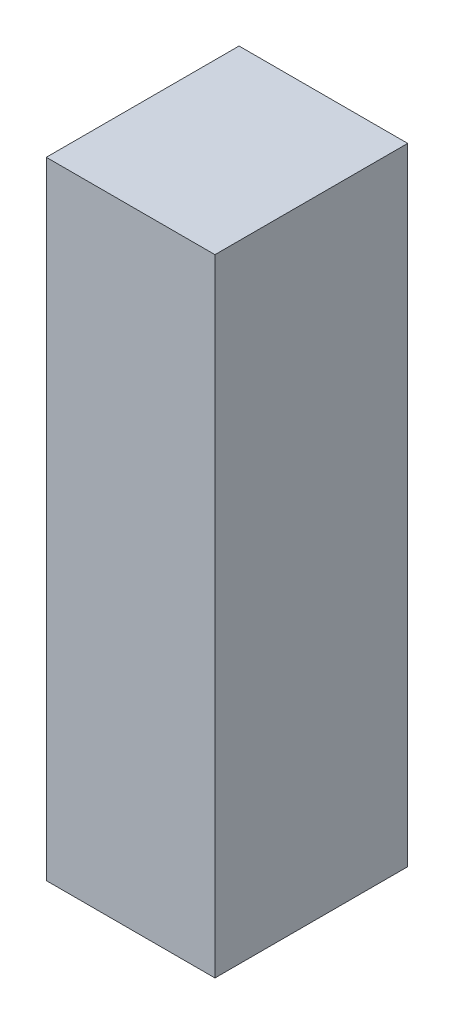
ISO-10303-21;
HEADER;
FILE_DESCRIPTION(('STEP AP214'),'2;1');
FILE_NAME('part.step','',(''),(''),'','','');
FILE_SCHEMA(('AUTOMOTIVE_DESIGN { 1 0 10303 214 1 1 1 1 }'));
ENDSEC;
DATA;
#1=APPLICATION_CONTEXT('core data for automotive mechanical design processes');
#2=APPLICATION_PROTOCOL_DEFINITION('international standard','automotive_design',2000,#1);
#3=PRODUCT_CONTEXT('',#1,'mechanical');
#4=PRODUCT('Part','Part','',(#3));
#5=PRODUCT_RELATED_PRODUCT_CATEGORY('part','',(#4));
#6=PRODUCT_DEFINITION_FORMATION('','',#4);
#7=PRODUCT_DEFINITION_CONTEXT('part definition',#1,'design');
#8=PRODUCT_DEFINITION('design','',#6,#7);
#9=PRODUCT_DEFINITION_SHAPE('','',#8);
#10=(LENGTH_UNIT() NAMED_UNIT(*) SI_UNIT(.MILLI.,.METRE.));
#11=(NAMED_UNIT(*) PLANE_ANGLE_UNIT() SI_UNIT($,.RADIAN.));
#12=(NAMED_UNIT(*) SI_UNIT($,.STERADIAN.) SOLID_ANGLE_UNIT());
#13=UNCERTAINTY_MEASURE_WITH_UNIT(LENGTH_MEASURE(1.E-05),#10,'distance_accuracy_value','');
#14=(GEOMETRIC_REPRESENTATION_CONTEXT(3) GLOBAL_UNCERTAINTY_ASSIGNED_CONTEXT((#13)) GLOBAL_UNIT_ASSIGNED_CONTEXT((#10,
#11,#12)) REPRESENTATION_CONTEXT('',''));
#15=CARTESIAN_POINT('',(0.,0.,0.));
#16=DIRECTION('',(0.,0.,1.));
#17=DIRECTION('',(1.,0.,0.));
#18=AXIS2_PLACEMENT_3D('',#15,#16,#17);
#19=CARTESIAN_POINT('',(-0.17499838,-0.6499987,0.));
#20=DIRECTION('',(-1.,0.,0.));
#21=DIRECTION('',(0.,0.,1.));
#22=AXIS2_PLACEMENT_3D('',#19,#20,#21);
#23=PLANE('',#22);
#24=DIRECTION('',(0.,0.,1.));
#25=VECTOR('',#24,1.);
#26=CARTESIAN_POINT('',(-0.17499838,0.65000124,0.));
#27=LINE('',#26,#25);
#28=CARTESIAN_POINT('',(-0.17499838,0.65000124,0.));
#29=VERTEX_POINT('',#28);
#30=CARTESIAN_POINT('',(-0.17499838,0.65000124,0.4));
#31=VERTEX_POINT('',#30);
#32=EDGE_CURVE('E19',#29,#31,#27,.T.);
#33=ORIENTED_EDGE('',*,*,#32,.F.);
#34=DIRECTION('',(0.,1.,0.));
#35=VECTOR('',#34,1.);
#36=CARTESIAN_POINT('',(-0.17499838,0.65000124,0.));
#37=LINE('',#36,#35);
#38=CARTESIAN_POINT('',(-0.17499838,-0.6499987,0.));
#39=VERTEX_POINT('',#38);
#40=EDGE_CURVE('E78',#29,#39,#37,.F.);
#41=ORIENTED_EDGE('',*,*,#40,.T.);
#42=DIRECTION('',(0.,0.,-1.));
#43=VECTOR('',#42,1.);
#44=CARTESIAN_POINT('',(-0.17499838,-0.6499987,0.));
#45=LINE('',#44,#43);
#46=CARTESIAN_POINT('',(-0.17499838,-0.6499987,0.4));
#47=VERTEX_POINT('',#46);
#48=EDGE_CURVE('E60',#47,#39,#45,.T.);
#49=ORIENTED_EDGE('',*,*,#48,.F.);
#50=DIRECTION('',(0.,1.,0.));
#51=VECTOR('',#50,1.);
#52=CARTESIAN_POINT('',(-0.17499838,0.65000124,0.4));
#53=LINE('',#52,#51);
#54=EDGE_CURVE('E55',#31,#47,#53,.F.);
#55=ORIENTED_EDGE('',*,*,#54,.F.);
#56=EDGE_LOOP('',(#33,#41,#49,#55));
#57=FACE_BOUND('',#56,.T.);
#58=ADVANCED_FACE('F16',(#57),#23,.T.);
#59=CARTESIAN_POINT('',(-0.17499838,0.65000124,0.));
#60=DIRECTION('',(0.,1.,0.));
#61=DIRECTION('',(0.,0.,1.));
#62=AXIS2_PLACEMENT_3D('',#59,#60,#61);
#63=PLANE('',#62);
#64=DIRECTION('',(0.,0.,-1.));
#65=VECTOR('',#64,1.);
#66=CARTESIAN_POINT('',(0.17500092,0.65000124,0.));
#67=LINE('',#66,#65);
#68=CARTESIAN_POINT('',(0.17500092,0.65000124,0.));
#69=VERTEX_POINT('',#68);
#70=CARTESIAN_POINT('',(0.17500092,0.65000124,0.4));
#71=VERTEX_POINT('',#70);
#72=EDGE_CURVE('E82',#69,#71,#67,.F.);
#73=ORIENTED_EDGE('',*,*,#72,.F.);
#74=DIRECTION('',(1.,0.,0.));
#75=VECTOR('',#74,1.);
#76=CARTESIAN_POINT('',(-0.17499838,0.65000124,0.));
#77=LINE('',#76,#75);
#78=EDGE_CURVE('E67',#69,#29,#77,.F.);
#79=ORIENTED_EDGE('',*,*,#78,.T.);
#80=ORIENTED_EDGE('',*,*,#32,.T.);
#81=DIRECTION('',(1.,0.,0.));
#82=VECTOR('',#81,1.);
#83=CARTESIAN_POINT('',(-0.17499838,0.65000124,0.4));
#84=LINE('',#83,#82);
#85=EDGE_CURVE('E62',#71,#31,#84,.F.);
#86=ORIENTED_EDGE('',*,*,#85,.F.);
#87=EDGE_LOOP('',(#73,#79,#80,#86));
#88=FACE_BOUND('',#87,.T.);
#89=ADVANCED_FACE('F64',(#88),#63,.T.);
#90=CARTESIAN_POINT('',(-0.17499838,0.65000124,0.4));
#91=DIRECTION('',(0.,0.,1.));
#92=DIRECTION('',(1.,0.,0.));
#93=AXIS2_PLACEMENT_3D('',#90,#91,#92);
#94=PLANE('',#93);
#95=DIRECTION('',(0.,1.,0.));
#96=VECTOR('',#95,1.);
#97=CARTESIAN_POINT('',(0.17500092,0.65000124,0.4));
#98=LINE('',#97,#96);
#99=CARTESIAN_POINT('',(0.17500092,-0.6499987,0.4));
#100=VERTEX_POINT('',#99);
#101=EDGE_CURVE('E71',#71,#100,#98,.F.);
#102=ORIENTED_EDGE('',*,*,#101,.F.);
#103=ORIENTED_EDGE('',*,*,#85,.T.);
#104=ORIENTED_EDGE('',*,*,#54,.T.);
#105=DIRECTION('',(1.,0.,0.));
#106=VECTOR('',#105,1.);
#107=CARTESIAN_POINT('',(0.17500092,-0.6499987,0.4));
#108=LINE('',#107,#106);
#109=EDGE_CURVE('E73',#100,#47,#108,.F.);
#110=ORIENTED_EDGE('',*,*,#109,.F.);
#111=EDGE_LOOP('',(#102,#103,#104,#110));
#112=FACE_BOUND('',#111,.T.);
#113=ADVANCED_FACE('F69',(#112),#94,.T.);
#114=CARTESIAN_POINT('',(0.17500092,-0.6499987,0.));
#115=DIRECTION('',(0.,-1.,0.));
#116=DIRECTION('',(0.,0.,-1.));
#117=AXIS2_PLACEMENT_3D('',#114,#115,#116);
#118=PLANE('',#117);
#119=ORIENTED_EDGE('',*,*,#48,.T.);
#120=DIRECTION('',(1.,0.,0.));
#121=VECTOR('',#120,1.);
#122=CARTESIAN_POINT('',(-0.17499838,-0.6499987,0.));
#123=LINE('',#122,#121);
#124=CARTESIAN_POINT('',(0.17500092,-0.6499987,0.));
#125=VERTEX_POINT('',#124);
#126=EDGE_CURVE('E34',#39,#125,#123,.T.);
#127=ORIENTED_EDGE('',*,*,#126,.T.);
#128=DIRECTION('',(0.,0.,-1.));
#129=VECTOR('',#128,1.);
#130=CARTESIAN_POINT('',(0.17500092,-0.6499987,0.));
#131=LINE('',#130,#129);
#132=EDGE_CURVE('E25',#100,#125,#131,.T.);
#133=ORIENTED_EDGE('',*,*,#132,.F.);
#134=ORIENTED_EDGE('',*,*,#109,.T.);
#135=EDGE_LOOP('',(#119,#127,#133,#134));
#136=FACE_BOUND('',#135,.T.);
#137=ADVANCED_FACE('F88',(#136),#118,.T.);
#138=CARTESIAN_POINT('',(-0.17499838,0.65000124,0.));
#139=DIRECTION('',(0.,0.,1.));
#140=DIRECTION('',(1.,0.,0.));
#141=AXIS2_PLACEMENT_3D('',#138,#139,#140);
#142=PLANE('',#141);
#143=DIRECTION('',(0.,1.,0.));
#144=VECTOR('',#143,1.);
#145=CARTESIAN_POINT('',(0.17500092,0.65000124,0.));
#146=LINE('',#145,#144);
#147=EDGE_CURVE('E11',#125,#69,#146,.T.);
#148=ORIENTED_EDGE('',*,*,#147,.F.);
#149=ORIENTED_EDGE('',*,*,#126,.F.);
#150=ORIENTED_EDGE('',*,*,#40,.F.);
#151=ORIENTED_EDGE('',*,*,#78,.F.);
#152=EDGE_LOOP('',(#148,#149,#150,#151));
#153=FACE_BOUND('',#152,.T.);
#154=ADVANCED_FACE('F90',(#153),#142,.F.);
#155=CARTESIAN_POINT('',(0.17500092,0.65000124,0.));
#156=DIRECTION('',(1.,0.,0.));
#157=DIRECTION('',(0.,0.,-1.));
#158=AXIS2_PLACEMENT_3D('',#155,#156,#157);
#159=PLANE('',#158);
#160=ORIENTED_EDGE('',*,*,#132,.T.);
#161=ORIENTED_EDGE('',*,*,#147,.T.);
#162=ORIENTED_EDGE('',*,*,#72,.T.);
#163=ORIENTED_EDGE('',*,*,#101,.T.);
#164=EDGE_LOOP('',(#160,#161,#162,#163));
#165=FACE_BOUND('',#164,.T.);
#166=ADVANCED_FACE('F87',(#165),#159,.T.);
#167=CLOSED_SHELL('',(#58,#89,#113,#137,#154,#166));
#168=MANIFOLD_SOLID_BREP('B1',#167);
#169=ADVANCED_BREP_SHAPE_REPRESENTATION('',(#18,#168),#14);
#170=SHAPE_DEFINITION_REPRESENTATION(#9,#169);
ENDSEC;
END-ISO-10303-21;
